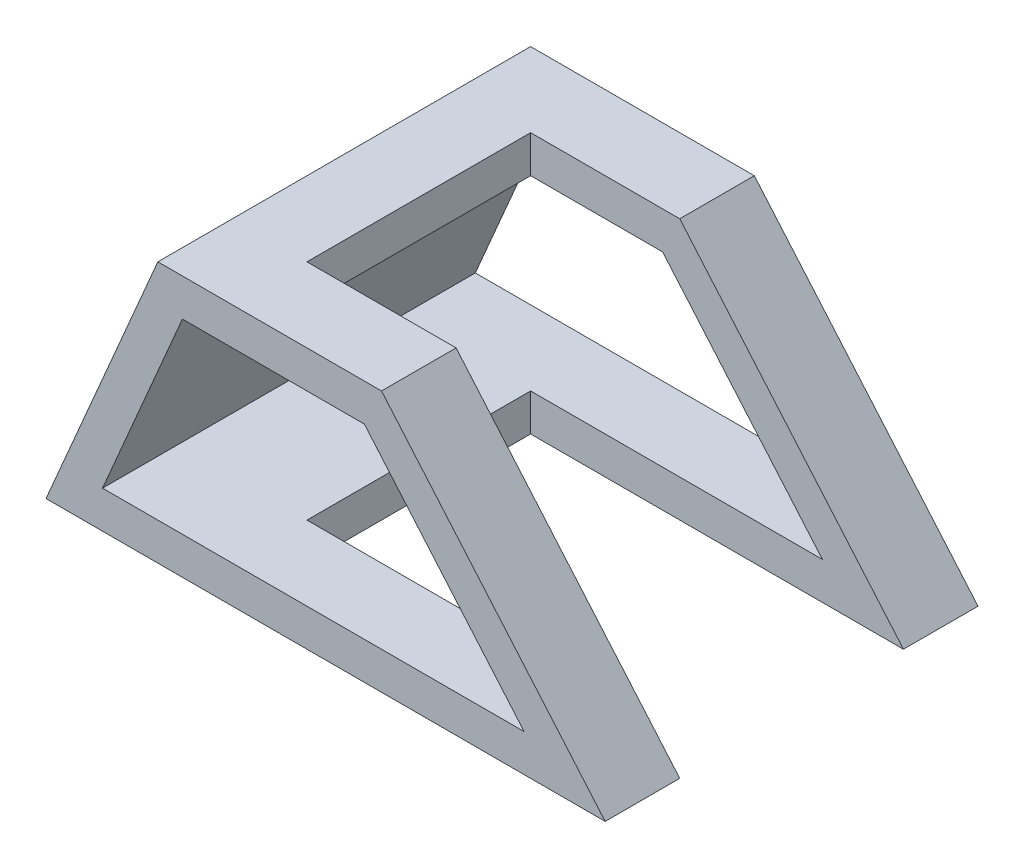
ISO-10303-21;
HEADER;
FILE_DESCRIPTION(('STEP AP214'),'2;1');
FILE_NAME('part.step','',(''),(''),'','','');
FILE_SCHEMA(('AUTOMOTIVE_DESIGN { 1 0 10303 214 1 1 1 1 }'));
ENDSEC;
DATA;
#1=APPLICATION_CONTEXT('core data for automotive mechanical design processes');
#2=APPLICATION_PROTOCOL_DEFINITION('international standard','automotive_design',2000,#1);
#3=PRODUCT_CONTEXT('',#1,'mechanical');
#4=PRODUCT('Part','Part','',(#3));
#5=PRODUCT_RELATED_PRODUCT_CATEGORY('part','',(#4));
#6=PRODUCT_DEFINITION_FORMATION('','',#4);
#7=PRODUCT_DEFINITION_CONTEXT('part definition',#1,'design');
#8=PRODUCT_DEFINITION('design','',#6,#7);
#9=PRODUCT_DEFINITION_SHAPE('','',#8);
#10=(LENGTH_UNIT() NAMED_UNIT(*) SI_UNIT(.MILLI.,.METRE.));
#11=(NAMED_UNIT(*) PLANE_ANGLE_UNIT() SI_UNIT($,.RADIAN.));
#12=(NAMED_UNIT(*) SI_UNIT($,.STERADIAN.) SOLID_ANGLE_UNIT());
#13=UNCERTAINTY_MEASURE_WITH_UNIT(LENGTH_MEASURE(1.E-05),#10,'distance_accuracy_value','');
#14=(GEOMETRIC_REPRESENTATION_CONTEXT(3) GLOBAL_UNCERTAINTY_ASSIGNED_CONTEXT((#13)) GLOBAL_UNIT_ASSIGNED_CONTEXT((#10,
#11,#12)) REPRESENTATION_CONTEXT('',''));
#15=CARTESIAN_POINT('',(0.,0.,0.));
#16=DIRECTION('',(0.,0.,1.));
#17=DIRECTION('',(1.,0.,0.));
#18=AXIS2_PLACEMENT_3D('',#15,#16,#17);
#19=CARTESIAN_POINT('',(90.,70.,-100.));
#20=DIRECTION('',(0.759256602365297,0.650791373455968,0.));
#21=DIRECTION('',(-0.650791373455968,0.759256602365297,0.));
#22=AXIS2_PLACEMENT_3D('',#19,#20,#21);
#23=PLANE('',#22);
#24=DIRECTION('',(-0.650791373455968,0.759256602365297,0.));
#25=VECTOR('',#24,1.);
#26=CARTESIAN_POINT('',(90.,70.,-80.));
#27=LINE('',#26,#25);
#28=CARTESIAN_POINT('',(150.,0.,-80.));
#29=VERTEX_POINT('',#28);
#30=CARTESIAN_POINT('',(90.,70.,-80.));
#31=VERTEX_POINT('',#30);
#32=EDGE_CURVE('E239',#29,#31,#27,.T.);
#33=ORIENTED_EDGE('',*,*,#32,.F.);
#34=DIRECTION('',(0.,0.,1.));
#35=VECTOR('',#34,1.);
#36=CARTESIAN_POINT('',(150.,0.,-100.));
#37=LINE('',#36,#35);
#38=CARTESIAN_POINT('',(150.,0.,-100.));
#39=VERTEX_POINT('',#38);
#40=EDGE_CURVE('E314',#39,#29,#37,.T.);
#41=ORIENTED_EDGE('',*,*,#40,.F.);
#42=DIRECTION('',(-0.650791373455968,0.759256602365297,0.));
#43=VECTOR('',#42,1.);
#44=CARTESIAN_POINT('',(90.,70.,-100.));
#45=LINE('',#44,#43);
#46=CARTESIAN_POINT('',(90.,70.,-100.));
#47=VERTEX_POINT('',#46);
#48=EDGE_CURVE('E283',#39,#47,#45,.T.);
#49=ORIENTED_EDGE('',*,*,#48,.T.);
#50=DIRECTION('',(0.,0.,1.));
#51=VECTOR('',#50,1.);
#52=CARTESIAN_POINT('',(90.,70.,-100.));
#53=LINE('',#52,#51);
#54=EDGE_CURVE('E310',#47,#31,#53,.T.);
#55=ORIENTED_EDGE('',*,*,#54,.T.);
#56=EDGE_LOOP('',(#33,#41,#49,#55));
#57=FACE_BOUND('',#56,.T.);
#58=ADVANCED_FACE('F85',(#57),#23,.T.);
#59=CARTESIAN_POINT('',(78.8780222116411,67.6097333242638,-100.));
#60=DIRECTION('',(0.759256602365297,0.650791373455968,0.));
#61=DIRECTION('',(-0.650791373455968,0.759256602365297,0.));
#62=AXIS2_PLACEMENT_3D('',#59,#60,#61);
#63=PLANE('',#62);
#64=DIRECTION('',(0.,0.,1.));
#65=VECTOR('',#64,1.);
#66=CARTESIAN_POINT('',(128.257793632439,9.99999999999999,-100.));
#67=LINE('',#66,#65);
#68=CARTESIAN_POINT('',(128.257793632439,9.99999999999999,-100.));
#69=VERTEX_POINT('',#68);
#70=CARTESIAN_POINT('',(128.257793632439,9.99999999999999,-80.));
#71=VERTEX_POINT('',#70);
#72=EDGE_CURVE('E278',#69,#71,#67,.T.);
#73=ORIENTED_EDGE('',*,*,#72,.T.);
#74=DIRECTION('',(-0.650791373455968,0.759256602365297,0.));
#75=VECTOR('',#74,1.);
#76=CARTESIAN_POINT('',(78.8780222116411,67.6097333242638,-80.));
#77=LINE('',#76,#75);
#78=CARTESIAN_POINT('',(85.4006507752958,60.,-80.));
#79=VERTEX_POINT('',#78);
#80=EDGE_CURVE('E233',#71,#79,#77,.T.);
#81=ORIENTED_EDGE('',*,*,#80,.T.);
#82=DIRECTION('',(0.,0.,1.));
#83=VECTOR('',#82,1.);
#84=CARTESIAN_POINT('',(85.4006507752959,60.,-100.));
#85=LINE('',#84,#83);
#86=CARTESIAN_POINT('',(85.4006507752959,60.,-100.));
#87=VERTEX_POINT('',#86);
#88=EDGE_CURVE('E274',#87,#79,#85,.T.);
#89=ORIENTED_EDGE('',*,*,#88,.F.);
#90=DIRECTION('',(-0.650791373455968,0.759256602365297,0.));
#91=VECTOR('',#90,1.);
#92=CARTESIAN_POINT('',(78.8780222116411,67.6097333242638,-100.));
#93=LINE('',#92,#91);
#94=EDGE_CURVE('E248',#69,#87,#93,.T.);
#95=ORIENTED_EDGE('',*,*,#94,.F.);
#96=EDGE_LOOP('',(#73,#81,#89,#95));
#97=FACE_BOUND('',#96,.T.);
#98=ADVANCED_FACE('F359',(#97),#63,.F.);
#99=CARTESIAN_POINT('',(30.,70.,-100.));
#100=DIRECTION('',(-0.919145030018058,0.393919298579168,0.));
#101=DIRECTION('',(-0.393919298579168,-0.919145030018058,0.));
#102=AXIS2_PLACEMENT_3D('',#99,#100,#101);
#103=PLANE('',#102);
#104=DIRECTION('',(-0.393919298579168,-0.919145030018058,0.));
#105=VECTOR('',#104,1.);
#106=CARTESIAN_POINT('',(30.,70.,0.));
#107=LINE('',#106,#105);
#108=CARTESIAN_POINT('',(30.,70.,0.));
#109=VERTEX_POINT('',#108);
#110=CARTESIAN_POINT('',(0.,0.,0.));
#111=VERTEX_POINT('',#110);
#112=EDGE_CURVE('E284',#109,#111,#107,.T.);
#113=ORIENTED_EDGE('',*,*,#112,.F.);
#114=DIRECTION('',(0.,0.,1.));
#115=VECTOR('',#114,1.);
#116=CARTESIAN_POINT('',(30.,70.,-100.));
#117=LINE('',#116,#115);
#118=CARTESIAN_POINT('',(30.,70.,-100.));
#119=VERTEX_POINT('',#118);
#120=EDGE_CURVE('E308',#119,#109,#117,.T.);
#121=ORIENTED_EDGE('',*,*,#120,.F.);
#122=DIRECTION('',(-0.393919298579168,-0.919145030018058,0.));
#123=VECTOR('',#122,1.);
#124=CARTESIAN_POINT('',(30.,70.,-100.));
#125=LINE('',#124,#123);
#126=CARTESIAN_POINT('',(0.,0.,-100.));
#127=VERTEX_POINT('',#126);
#128=EDGE_CURVE('E290',#119,#127,#125,.T.);
#129=ORIENTED_EDGE('',*,*,#128,.T.);
#130=DIRECTION('',(0.,0.,1.));
#131=VECTOR('',#130,1.);
#132=CARTESIAN_POINT('',(0.,0.,-100.));
#133=LINE('',#132,#131);
#134=EDGE_CURVE('E304',#127,#111,#133,.T.);
#135=ORIENTED_EDGE('',*,*,#134,.T.);
#136=EDGE_LOOP('',(#113,#121,#129,#135));
#137=FACE_BOUND('',#136,.T.);
#138=ADVANCED_FACE('F346',(#137),#103,.T.);
#139=CARTESIAN_POINT('',(30.,70.,-100.));
#140=DIRECTION('',(0.,1.,0.));
#141=DIRECTION('',(0.,0.,1.));
#142=AXIS2_PLACEMENT_3D('',#139,#140,#141);
#143=PLANE('',#142);
#144=DIRECTION('',(-1.,0.,0.));
#145=VECTOR('',#144,1.);
#146=CARTESIAN_POINT('',(50.,70.,-80.));
#147=LINE('',#146,#145);
#148=CARTESIAN_POINT('',(50.,70.,-80.));
#149=VERTEX_POINT('',#148);
#150=EDGE_CURVE('E213',#31,#149,#147,.T.);
#151=ORIENTED_EDGE('',*,*,#150,.F.);
#152=ORIENTED_EDGE('',*,*,#54,.F.);
#153=DIRECTION('',(-1.,0.,0.));
#154=VECTOR('',#153,1.);
#155=CARTESIAN_POINT('',(30.,70.,-100.));
#156=LINE('',#155,#154);
#157=EDGE_CURVE('E287',#47,#119,#156,.T.);
#158=ORIENTED_EDGE('',*,*,#157,.T.);
#159=ORIENTED_EDGE('',*,*,#120,.T.);
#160=DIRECTION('',(-1.,0.,0.));
#161=VECTOR('',#160,1.);
#162=CARTESIAN_POINT('',(30.,70.,0.));
#163=LINE('',#162,#161);
#164=CARTESIAN_POINT('',(90.,70.,0.));
#165=VERTEX_POINT('',#164);
#166=EDGE_CURVE('E299',#165,#109,#163,.T.);
#167=ORIENTED_EDGE('',*,*,#166,.F.);
#168=CARTESIAN_POINT('',(90.,70.,-20.));
#169=VERTEX_POINT('',#168);
#170=EDGE_CURVE('E313',#169,#165,#53,.T.);
#171=ORIENTED_EDGE('',*,*,#170,.F.);
#172=DIRECTION('',(1.,0.,0.));
#173=VECTOR('',#172,1.);
#174=CARTESIAN_POINT('',(50.,70.,-20.));
#175=LINE('',#174,#173);
#176=CARTESIAN_POINT('',(50.,70.,-20.));
#177=VERTEX_POINT('',#176);
#178=EDGE_CURVE('E216',#177,#169,#175,.T.);
#179=ORIENTED_EDGE('',*,*,#178,.F.);
#180=DIRECTION('',(0.,0.,1.));
#181=VECTOR('',#180,1.);
#182=CARTESIAN_POINT('',(50.,70.,-80.));
#183=LINE('',#182,#181);
#184=EDGE_CURVE('E220',#149,#177,#183,.T.);
#185=ORIENTED_EDGE('',*,*,#184,.F.);
#186=EDGE_LOOP('',(#151,#152,#158,#159,#167,#171,#179,#185));
#187=FACE_BOUND('',#186,.T.);
#188=ADVANCED_FACE('F337',(#187),#143,.T.);
#189=DIRECTION('',(0.650791373455968,-0.759256602365297,0.));
#190=VECTOR('',#189,1.);
#191=CARTESIAN_POINT('',(90.,70.,-20.));
#192=LINE('',#191,#190);
#193=CARTESIAN_POINT('',(150.,0.,-20.));
#194=VERTEX_POINT('',#193);
#195=EDGE_CURVE('E100',#169,#194,#192,.T.);
#196=ORIENTED_EDGE('',*,*,#195,.F.);
#197=ORIENTED_EDGE('',*,*,#170,.T.);
#198=DIRECTION('',(-0.650791373455968,0.759256602365297,0.));
#199=VECTOR('',#198,1.);
#200=CARTESIAN_POINT('',(90.,70.,0.));
#201=LINE('',#200,#199);
#202=CARTESIAN_POINT('',(150.,0.,0.));
#203=VERTEX_POINT('',#202);
#204=EDGE_CURVE('E296',#203,#165,#201,.T.);
#205=ORIENTED_EDGE('',*,*,#204,.F.);
#206=EDGE_CURVE('E293',#194,#203,#37,.T.);
#207=ORIENTED_EDGE('',*,*,#206,.F.);
#208=EDGE_LOOP('',(#196,#197,#205,#207));
#209=FACE_BOUND('',#208,.T.);
#210=ADVANCED_FACE('F340',(#209),#23,.T.);
#211=CARTESIAN_POINT('',(150.,0.,-100.));
#212=DIRECTION('',(0.,-1.,0.));
#213=DIRECTION('',(1.,0.,0.));
#214=AXIS2_PLACEMENT_3D('',#211,#212,#213);
#215=PLANE('',#214);
#216=DIRECTION('',(-1.,0.,0.));
#217=VECTOR('',#216,1.);
#218=CARTESIAN_POINT('',(50.,0.,-80.));
#219=LINE('',#218,#217);
#220=CARTESIAN_POINT('',(50.,0.,-80.));
#221=VERTEX_POINT('',#220);
#222=EDGE_CURVE('E210',#29,#221,#219,.T.);
#223=ORIENTED_EDGE('',*,*,#222,.T.);
#224=DIRECTION('',(0.,0.,1.));
#225=VECTOR('',#224,1.);
#226=CARTESIAN_POINT('',(50.,0.,-80.));
#227=LINE('',#226,#225);
#228=CARTESIAN_POINT('',(50.,0.,-20.));
#229=VERTEX_POINT('',#228);
#230=EDGE_CURVE('E199',#221,#229,#227,.T.);
#231=ORIENTED_EDGE('',*,*,#230,.T.);
#232=DIRECTION('',(1.,0.,0.));
#233=VECTOR('',#232,1.);
#234=CARTESIAN_POINT('',(50.,0.,-20.));
#235=LINE('',#234,#233);
#236=EDGE_CURVE('E206',#229,#194,#235,.T.);
#237=ORIENTED_EDGE('',*,*,#236,.T.);
#238=ORIENTED_EDGE('',*,*,#206,.T.);
#239=DIRECTION('',(1.,0.,0.));
#240=VECTOR('',#239,1.);
#241=CARTESIAN_POINT('',(150.,0.,0.));
#242=LINE('',#241,#240);
#243=EDGE_CURVE('E271',#111,#203,#242,.T.);
#244=ORIENTED_EDGE('',*,*,#243,.F.);
#245=ORIENTED_EDGE('',*,*,#134,.F.);
#246=DIRECTION('',(1.,0.,0.));
#247=VECTOR('',#246,1.);
#248=CARTESIAN_POINT('',(0.,0.,-100.));
#249=LINE('',#248,#247);
#250=EDGE_CURVE('E281',#127,#39,#249,.T.);
#251=ORIENTED_EDGE('',*,*,#250,.T.);
#252=ORIENTED_EDGE('',*,*,#40,.T.);
#253=EDGE_LOOP('',(#223,#231,#237,#238,#244,#245,#251,#252));
#254=FACE_BOUND('',#253,.T.);
#255=ADVANCED_FACE('F87',(#254),#215,.T.);
#256=CARTESIAN_POINT('',(0.,0.,-100.));
#257=DIRECTION('',(0.,0.,-1.));
#258=DIRECTION('',(-1.,0.,0.));
#259=AXIS2_PLACEMENT_3D('',#256,#257,#258);
#260=PLANE('',#259);
#261=DIRECTION('',(-0.393919298579168,-0.919145030018058,0.));
#262=VECTOR('',#261,1.);
#263=CARTESIAN_POINT('',(9.19145030018058,-3.93919298579168,-100.));
#264=LINE('',#263,#262);
#265=CARTESIAN_POINT('',(36.5939615798056,60.,-100.));
#266=VERTEX_POINT('',#265);
#267=CARTESIAN_POINT('',(15.1653901512341,10.,-100.));
#268=VERTEX_POINT('',#267);
#269=EDGE_CURVE('E255',#266,#268,#264,.T.);
#270=ORIENTED_EDGE('',*,*,#269,.T.);
#271=DIRECTION('',(1.,0.,0.));
#272=VECTOR('',#271,1.);
#273=CARTESIAN_POINT('',(0.,10.,-100.));
#274=LINE('',#273,#272);
#275=EDGE_CURVE('E245',#268,#69,#274,.T.);
#276=ORIENTED_EDGE('',*,*,#275,.T.);
#277=ORIENTED_EDGE('',*,*,#94,.T.);
#278=DIRECTION('',(-1.,0.,0.));
#279=VECTOR('',#278,1.);
#280=CARTESIAN_POINT('',(0.,60.,-100.));
#281=LINE('',#280,#279);
#282=EDGE_CURVE('E252',#87,#266,#281,.T.);
#283=ORIENTED_EDGE('',*,*,#282,.T.);
#284=EDGE_LOOP('',(#270,#276,#277,#283));
#285=FACE_BOUND('',#284,.T.);
#286=ORIENTED_EDGE('',*,*,#250,.F.);
#287=ORIENTED_EDGE('',*,*,#128,.F.);
#288=ORIENTED_EDGE('',*,*,#157,.F.);
#289=ORIENTED_EDGE('',*,*,#48,.F.);
#290=EDGE_LOOP('',(#286,#287,#288,#289));
#291=FACE_BOUND('',#290,.T.);
#292=ADVANCED_FACE('F352',(#285,#291),#260,.T.);
#293=CARTESIAN_POINT('',(0.,0.,0.));
#294=DIRECTION('',(0.,0.,-1.));
#295=DIRECTION('',(-1.,0.,0.));
#296=AXIS2_PLACEMENT_3D('',#293,#294,#295);
#297=PLANE('',#296);
#298=DIRECTION('',(1.,0.,0.));
#299=VECTOR('',#298,1.);
#300=CARTESIAN_POINT('',(0.,9.99999999999998,0.));
#301=LINE('',#300,#299);
#302=CARTESIAN_POINT('',(15.1653901512341,9.99999999999998,0.));
#303=VERTEX_POINT('',#302);
#304=CARTESIAN_POINT('',(128.257793632439,9.99999999999999,0.));
#305=VERTEX_POINT('',#304);
#306=EDGE_CURVE('E244',#303,#305,#301,.T.);
#307=ORIENTED_EDGE('',*,*,#306,.F.);
#308=DIRECTION('',(-0.393919298579168,-0.919145030018058,0.));
#309=VECTOR('',#308,1.);
#310=CARTESIAN_POINT('',(9.19145030018058,-3.93919298579168,0.));
#311=LINE('',#310,#309);
#312=CARTESIAN_POINT('',(36.5939615798056,60.,0.));
#313=VERTEX_POINT('',#312);
#314=EDGE_CURVE('E249',#313,#303,#311,.T.);
#315=ORIENTED_EDGE('',*,*,#314,.F.);
#316=DIRECTION('',(-1.,0.,0.));
#317=VECTOR('',#316,1.);
#318=CARTESIAN_POINT('',(0.,60.,0.));
#319=LINE('',#318,#317);
#320=CARTESIAN_POINT('',(85.4006507752959,60.,0.));
#321=VERTEX_POINT('',#320);
#322=EDGE_CURVE('E264',#321,#313,#319,.T.);
#323=ORIENTED_EDGE('',*,*,#322,.F.);
#324=DIRECTION('',(-0.650791373455968,0.759256602365297,0.));
#325=VECTOR('',#324,1.);
#326=CARTESIAN_POINT('',(78.8780222116411,67.6097333242638,0.));
#327=LINE('',#326,#325);
#328=EDGE_CURVE('E261',#305,#321,#327,.T.);
#329=ORIENTED_EDGE('',*,*,#328,.F.);
#330=EDGE_LOOP('',(#307,#315,#323,#329));
#331=FACE_BOUND('',#330,.T.);
#332=ORIENTED_EDGE('',*,*,#112,.T.);
#333=ORIENTED_EDGE('',*,*,#243,.T.);
#334=ORIENTED_EDGE('',*,*,#204,.T.);
#335=ORIENTED_EDGE('',*,*,#166,.T.);
#336=EDGE_LOOP('',(#332,#333,#334,#335));
#337=FACE_BOUND('',#336,.T.);
#338=ADVANCED_FACE('F348',(#331,#337),#297,.F.);
#339=CARTESIAN_POINT('',(9.19145030018058,-3.93919298579168,-100.));
#340=DIRECTION('',(-0.919145030018058,0.393919298579168,0.));
#341=DIRECTION('',(-0.393919298579168,-0.919145030018058,0.));
#342=AXIS2_PLACEMENT_3D('',#339,#340,#341);
#343=PLANE('',#342);
#344=ORIENTED_EDGE('',*,*,#314,.T.);
#345=DIRECTION('',(0.,0.,1.));
#346=VECTOR('',#345,1.);
#347=CARTESIAN_POINT('',(15.1653901512341,10.,-100.));
#348=LINE('',#347,#346);
#349=EDGE_CURVE('E268',#268,#303,#348,.T.);
#350=ORIENTED_EDGE('',*,*,#349,.F.);
#351=ORIENTED_EDGE('',*,*,#269,.F.);
#352=DIRECTION('',(0.,0.,1.));
#353=VECTOR('',#352,1.);
#354=CARTESIAN_POINT('',(36.5939615798056,60.,-100.));
#355=LINE('',#354,#353);
#356=EDGE_CURVE('E272',#266,#313,#355,.T.);
#357=ORIENTED_EDGE('',*,*,#356,.T.);
#358=EDGE_LOOP('',(#344,#350,#351,#357));
#359=FACE_BOUND('',#358,.T.);
#360=ADVANCED_FACE('F366',(#359),#343,.F.);
#361=CARTESIAN_POINT('',(0.,60.,-100.));
#362=DIRECTION('',(0.,1.,0.));
#363=DIRECTION('',(0.,0.,1.));
#364=AXIS2_PLACEMENT_3D('',#361,#362,#363);
#365=PLANE('',#364);
#366=ORIENTED_EDGE('',*,*,#88,.T.);
#367=DIRECTION('',(-1.,0.,0.));
#368=VECTOR('',#367,1.);
#369=CARTESIAN_POINT('',(0.,60.,-80.));
#370=LINE('',#369,#368);
#371=CARTESIAN_POINT('',(50.,60.,-80.));
#372=VERTEX_POINT('',#371);
#373=EDGE_CURVE('E236',#79,#372,#370,.T.);
#374=ORIENTED_EDGE('',*,*,#373,.T.);
#375=DIRECTION('',(0.,0.,1.));
#376=VECTOR('',#375,1.);
#377=CARTESIAN_POINT('',(50.,60.,-100.));
#378=LINE('',#377,#376);
#379=CARTESIAN_POINT('',(50.,60.,-20.));
#380=VERTEX_POINT('',#379);
#381=EDGE_CURVE('E241',#372,#380,#378,.T.);
#382=ORIENTED_EDGE('',*,*,#381,.T.);
#383=DIRECTION('',(1.,0.,0.));
#384=VECTOR('',#383,1.);
#385=CARTESIAN_POINT('',(0.,60.,-20.));
#386=LINE('',#385,#384);
#387=CARTESIAN_POINT('',(85.4006507752958,60.,-20.));
#388=VERTEX_POINT('',#387);
#389=EDGE_CURVE('E229',#380,#388,#386,.T.);
#390=ORIENTED_EDGE('',*,*,#389,.T.);
#391=EDGE_CURVE('E277',#388,#321,#85,.T.);
#392=ORIENTED_EDGE('',*,*,#391,.T.);
#393=ORIENTED_EDGE('',*,*,#322,.T.);
#394=ORIENTED_EDGE('',*,*,#356,.F.);
#395=ORIENTED_EDGE('',*,*,#282,.F.);
#396=EDGE_LOOP('',(#366,#374,#382,#390,#392,#393,#394,#395));
#397=FACE_BOUND('',#396,.T.);
#398=ADVANCED_FACE('F326',(#397),#365,.F.);
#399=ORIENTED_EDGE('',*,*,#391,.F.);
#400=DIRECTION('',(0.650791373455968,-0.759256602365297,0.));
#401=VECTOR('',#400,1.);
#402=CARTESIAN_POINT('',(78.8780222116411,67.6097333242638,-20.));
#403=LINE('',#402,#401);
#404=CARTESIAN_POINT('',(128.257793632439,9.99999999999999,-20.));
#405=VERTEX_POINT('',#404);
#406=EDGE_CURVE('E225',#388,#405,#403,.T.);
#407=ORIENTED_EDGE('',*,*,#406,.T.);
#408=EDGE_CURVE('E258',#405,#305,#67,.T.);
#409=ORIENTED_EDGE('',*,*,#408,.T.);
#410=ORIENTED_EDGE('',*,*,#328,.T.);
#411=EDGE_LOOP('',(#399,#407,#409,#410));
#412=FACE_BOUND('',#411,.T.);
#413=ADVANCED_FACE('F322',(#412),#63,.F.);
#414=CARTESIAN_POINT('',(0.,9.99999999999998,-100.));
#415=DIRECTION('',(0.,-1.,0.));
#416=DIRECTION('',(1.,0.,0.));
#417=AXIS2_PLACEMENT_3D('',#414,#415,#416);
#418=PLANE('',#417);
#419=DIRECTION('',(0.,0.,-1.));
#420=VECTOR('',#419,1.);
#421=CARTESIAN_POINT('',(50.,9.99999999999999,-100.));
#422=LINE('',#421,#420);
#423=CARTESIAN_POINT('',(50.,9.99999999999999,-20.));
#424=VERTEX_POINT('',#423);
#425=CARTESIAN_POINT('',(50.,9.99999999999999,-80.));
#426=VERTEX_POINT('',#425);
#427=EDGE_CURVE('E93',#424,#426,#422,.T.);
#428=ORIENTED_EDGE('',*,*,#427,.T.);
#429=DIRECTION('',(1.,0.,0.));
#430=VECTOR('',#429,1.);
#431=CARTESIAN_POINT('',(0.,9.99999999999998,-80.));
#432=LINE('',#431,#430);
#433=EDGE_CURVE('E12',#426,#71,#432,.T.);
#434=ORIENTED_EDGE('',*,*,#433,.T.);
#435=ORIENTED_EDGE('',*,*,#72,.F.);
#436=ORIENTED_EDGE('',*,*,#275,.F.);
#437=ORIENTED_EDGE('',*,*,#349,.T.);
#438=ORIENTED_EDGE('',*,*,#306,.T.);
#439=ORIENTED_EDGE('',*,*,#408,.F.);
#440=DIRECTION('',(-1.,0.,0.));
#441=VECTOR('',#440,1.);
#442=CARTESIAN_POINT('',(0.,9.99999999999998,-20.));
#443=LINE('',#442,#441);
#444=EDGE_CURVE('E307',#405,#424,#443,.T.);
#445=ORIENTED_EDGE('',*,*,#444,.T.);
#446=EDGE_LOOP('',(#428,#434,#435,#436,#437,#438,#439,#445));
#447=FACE_BOUND('',#446,.T.);
#448=ADVANCED_FACE('F317',(#447),#418,.F.);
#449=CARTESIAN_POINT('',(50.,0.,-80.));
#450=DIRECTION('',(-1.,0.,0.));
#451=DIRECTION('',(0.,0.,1.));
#452=AXIS2_PLACEMENT_3D('',#449,#450,#451);
#453=PLANE('',#452);
#454=DIRECTION('',(0.,1.,0.));
#455=VECTOR('',#454,1.);
#456=CARTESIAN_POINT('',(50.,0.,-80.));
#457=LINE('',#456,#455);
#458=EDGE_CURVE('E203',#372,#149,#457,.T.);
#459=ORIENTED_EDGE('',*,*,#458,.T.);
#460=ORIENTED_EDGE('',*,*,#184,.T.);
#461=DIRECTION('',(0.,1.,0.));
#462=VECTOR('',#461,1.);
#463=CARTESIAN_POINT('',(50.,0.,-20.));
#464=LINE('',#463,#462);
#465=EDGE_CURVE('E204',#380,#177,#464,.T.);
#466=ORIENTED_EDGE('',*,*,#465,.F.);
#467=ORIENTED_EDGE('',*,*,#381,.F.);
#468=EDGE_LOOP('',(#459,#460,#466,#467));
#469=FACE_BOUND('',#468,.T.);
#470=ADVANCED_FACE('F330',(#469),#453,.F.);
#471=EDGE_CURVE('E106',#229,#424,#464,.T.);
#472=ORIENTED_EDGE('',*,*,#471,.F.);
#473=ORIENTED_EDGE('',*,*,#230,.F.);
#474=EDGE_CURVE('E224',#221,#426,#457,.T.);
#475=ORIENTED_EDGE('',*,*,#474,.T.);
#476=ORIENTED_EDGE('',*,*,#427,.F.);
#477=EDGE_LOOP('',(#472,#473,#475,#476));
#478=FACE_BOUND('',#477,.T.);
#479=ADVANCED_FACE('F196',(#478),#453,.F.);
#480=CARTESIAN_POINT('',(50.,0.,-80.));
#481=DIRECTION('',(0.,0.,-1.));
#482=DIRECTION('',(-1.,0.,0.));
#483=AXIS2_PLACEMENT_3D('',#480,#481,#482);
#484=PLANE('',#483);
#485=ORIENTED_EDGE('',*,*,#32,.T.);
#486=ORIENTED_EDGE('',*,*,#150,.T.);
#487=ORIENTED_EDGE('',*,*,#458,.F.);
#488=ORIENTED_EDGE('',*,*,#373,.F.);
#489=ORIENTED_EDGE('',*,*,#80,.F.);
#490=ORIENTED_EDGE('',*,*,#433,.F.);
#491=ORIENTED_EDGE('',*,*,#474,.F.);
#492=ORIENTED_EDGE('',*,*,#222,.F.);
#493=EDGE_LOOP('',(#485,#486,#487,#488,#489,#490,#491,#492));
#494=FACE_BOUND('',#493,.T.);
#495=ADVANCED_FACE('F357',(#494),#484,.F.);
#496=CARTESIAN_POINT('',(50.,0.,-20.));
#497=DIRECTION('',(0.,0.,1.));
#498=DIRECTION('',(1.,0.,0.));
#499=AXIS2_PLACEMENT_3D('',#496,#497,#498);
#500=PLANE('',#499);
#501=ORIENTED_EDGE('',*,*,#195,.T.);
#502=ORIENTED_EDGE('',*,*,#236,.F.);
#503=ORIENTED_EDGE('',*,*,#471,.T.);
#504=ORIENTED_EDGE('',*,*,#444,.F.);
#505=ORIENTED_EDGE('',*,*,#406,.F.);
#506=ORIENTED_EDGE('',*,*,#389,.F.);
#507=ORIENTED_EDGE('',*,*,#465,.T.);
#508=ORIENTED_EDGE('',*,*,#178,.T.);
#509=EDGE_LOOP('',(#501,#502,#503,#504,#505,#506,#507,#508));
#510=FACE_BOUND('',#509,.T.);
#511=ADVANCED_FACE('F207',(#510),#500,.F.);
#512=CLOSED_SHELL('',(#58,#98,#138,#188,#210,#255,#292,#338,#360,#398,#413,#448,#470,#479,#495,#511));
#513=MANIFOLD_SOLID_BREP('B2',#512);
#514=ADVANCED_BREP_SHAPE_REPRESENTATION('',(#18,#513),#14);
#515=SHAPE_DEFINITION_REPRESENTATION(#9,#514);
ENDSEC;
END-ISO-10303-21;
